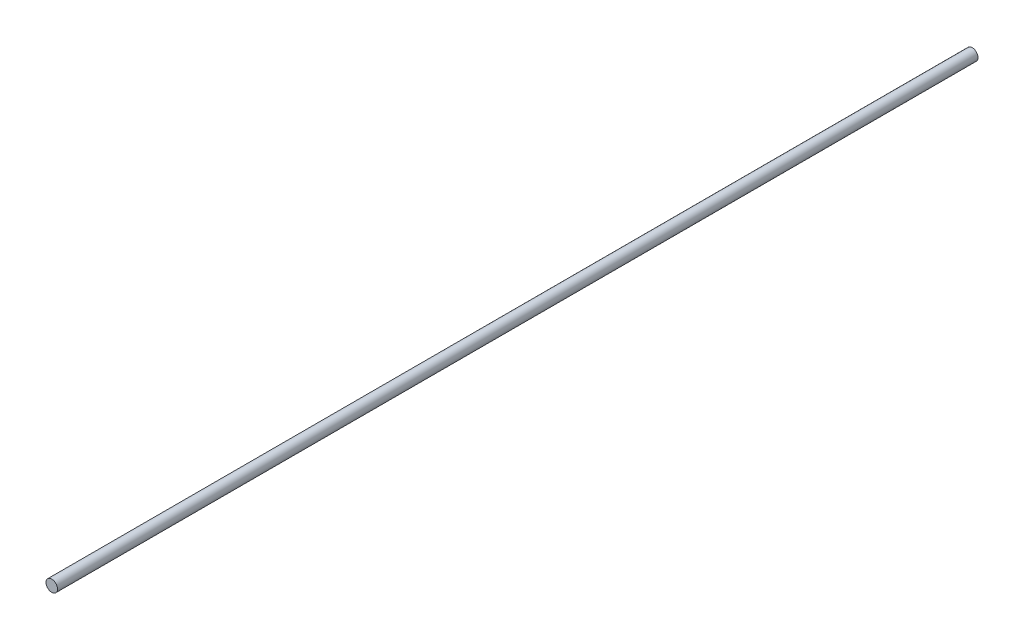
ISO-10303-21;
HEADER;
FILE_DESCRIPTION(('STEP AP214'),'2;1');
FILE_NAME('part.step','',(''),(''),'','','');
FILE_SCHEMA(('AUTOMOTIVE_DESIGN { 1 0 10303 214 1 1 1 1 }'));
ENDSEC;
DATA;
#1=APPLICATION_CONTEXT('core data for automotive mechanical design processes');
#2=APPLICATION_PROTOCOL_DEFINITION('international standard','automotive_design',2000,#1);
#3=PRODUCT_CONTEXT('',#1,'mechanical');
#4=PRODUCT('Part','Part','',(#3));
#5=PRODUCT_RELATED_PRODUCT_CATEGORY('part','',(#4));
#6=PRODUCT_DEFINITION_FORMATION('','',#4);
#7=PRODUCT_DEFINITION_CONTEXT('part definition',#1,'design');
#8=PRODUCT_DEFINITION('design','',#6,#7);
#9=PRODUCT_DEFINITION_SHAPE('','',#8);
#10=(LENGTH_UNIT() NAMED_UNIT(*) SI_UNIT(.MILLI.,.METRE.));
#11=(NAMED_UNIT(*) PLANE_ANGLE_UNIT() SI_UNIT($,.RADIAN.));
#12=(NAMED_UNIT(*) SI_UNIT($,.STERADIAN.) SOLID_ANGLE_UNIT());
#13=UNCERTAINTY_MEASURE_WITH_UNIT(LENGTH_MEASURE(1.E-05),#10,'distance_accuracy_value','');
#14=(GEOMETRIC_REPRESENTATION_CONTEXT(3) GLOBAL_UNCERTAINTY_ASSIGNED_CONTEXT((#13)) GLOBAL_UNIT_ASSIGNED_CONTEXT((#10,
#11,#12)) REPRESENTATION_CONTEXT('',''));
#15=CARTESIAN_POINT('',(0.,0.,0.));
#16=DIRECTION('',(0.,0.,1.));
#17=DIRECTION('',(1.,0.,0.));
#18=AXIS2_PLACEMENT_3D('',#15,#16,#17);
#19=CARTESIAN_POINT('',(0.,0.,640.));
#20=DIRECTION('',(0.,0.,-1.));
#21=DIRECTION('',(-1.,0.,0.));
#22=AXIS2_PLACEMENT_3D('',#19,#20,#21);
#23=CYLINDRICAL_SURFACE('',#22,4.);
#24=CARTESIAN_POINT('',(0.,0.,640.));
#25=DIRECTION('',(0.,0.,1.));
#26=DIRECTION('',(1.,0.,0.));
#27=AXIS2_PLACEMENT_3D('',#24,#25,#26);
#28=CIRCLE('',#27,4.);
#29=CARTESIAN_POINT('',(4.,0.,640.));
#30=VERTEX_POINT('',#29);
#31=EDGE_CURVE('E10',#30,#30,#28,.T.);
#32=ORIENTED_EDGE('',*,*,#31,.F.);
#33=EDGE_LOOP('',(#32));
#34=FACE_BOUND('',#33,.T.);
#35=CARTESIAN_POINT('',(0.,0.,0.));
#36=DIRECTION('',(0.,0.,1.));
#37=DIRECTION('',(1.,0.,0.));
#38=AXIS2_PLACEMENT_3D('',#35,#36,#37);
#39=CIRCLE('',#38,4.);
#40=CARTESIAN_POINT('',(4.,0.,0.));
#41=VERTEX_POINT('',#40);
#42=EDGE_CURVE('E34',#41,#41,#39,.T.);
#43=ORIENTED_EDGE('',*,*,#42,.T.);
#44=EDGE_LOOP('',(#43));
#45=FACE_BOUND('',#44,.T.);
#46=ADVANCED_FACE('F31',(#34,#45),#23,.T.);
#47=CARTESIAN_POINT('',(0.,0.,640.));
#48=DIRECTION('',(0.,0.,1.));
#49=DIRECTION('',(1.,0.,0.));
#50=AXIS2_PLACEMENT_3D('',#47,#48,#49);
#51=PLANE('',#50);
#52=ORIENTED_EDGE('',*,*,#31,.T.);
#53=EDGE_LOOP('',(#52));
#54=FACE_BOUND('',#53,.T.);
#55=ADVANCED_FACE('F46',(#54),#51,.T.);
#56=CARTESIAN_POINT('',(0.,0.,0.));
#57=DIRECTION('',(0.,0.,1.));
#58=DIRECTION('',(1.,0.,0.));
#59=AXIS2_PLACEMENT_3D('',#56,#57,#58);
#60=PLANE('',#59);
#61=ORIENTED_EDGE('',*,*,#42,.F.);
#62=EDGE_LOOP('',(#61));
#63=FACE_BOUND('',#62,.T.);
#64=ADVANCED_FACE('F44',(#63),#60,.F.);
#65=CLOSED_SHELL('',(#46,#55,#64));
#66=MANIFOLD_SOLID_BREP('B2',#65);
#67=ADVANCED_BREP_SHAPE_REPRESENTATION('',(#18,#66),#14);
#68=SHAPE_DEFINITION_REPRESENTATION(#9,#67);
ENDSEC;
END-ISO-10303-21;
